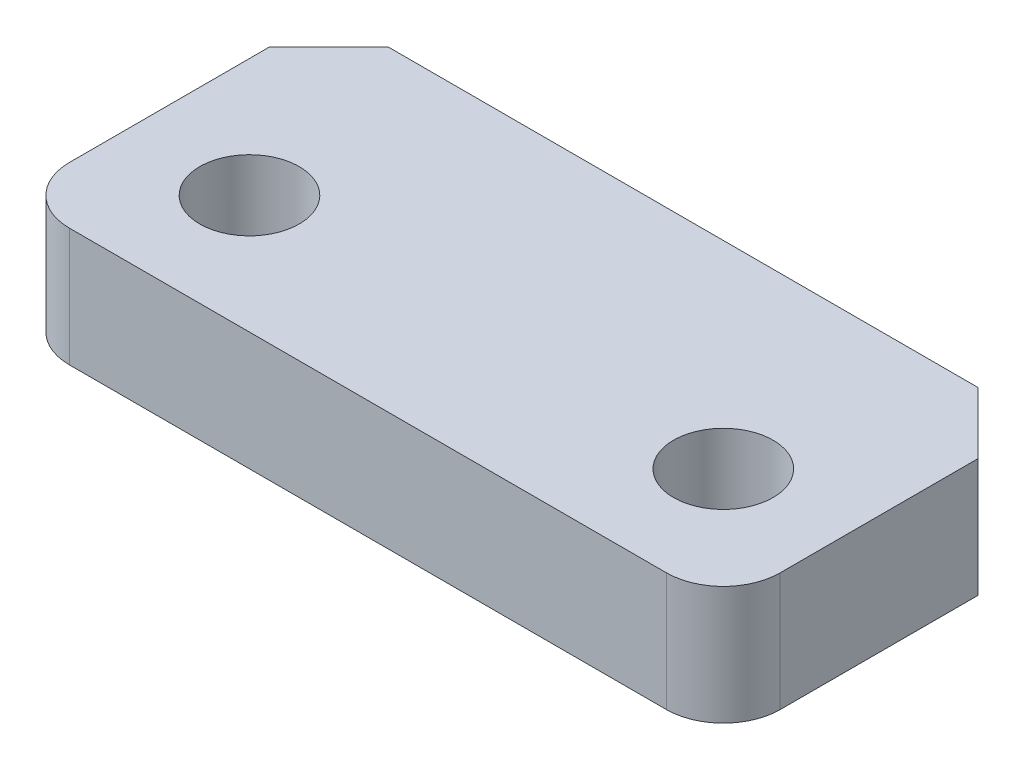
ISO-10303-21;
HEADER;
FILE_DESCRIPTION(('STEP AP214'),'2;1');
FILE_NAME('part.step','',(''),(''),'','','');
FILE_SCHEMA(('AUTOMOTIVE_DESIGN { 1 0 10303 214 1 1 1 1 }'));
ENDSEC;
DATA;
#1=APPLICATION_CONTEXT('core data for automotive mechanical design processes');
#2=APPLICATION_PROTOCOL_DEFINITION('international standard','automotive_design',2000,#1);
#3=PRODUCT_CONTEXT('',#1,'mechanical');
#4=PRODUCT('Part','Part','',(#3));
#5=PRODUCT_RELATED_PRODUCT_CATEGORY('part','',(#4));
#6=PRODUCT_DEFINITION_FORMATION('','',#4);
#7=PRODUCT_DEFINITION_CONTEXT('part definition',#1,'design');
#8=PRODUCT_DEFINITION('design','',#6,#7);
#9=PRODUCT_DEFINITION_SHAPE('','',#8);
#10=(LENGTH_UNIT() NAMED_UNIT(*) SI_UNIT(.MILLI.,.METRE.));
#11=(NAMED_UNIT(*) PLANE_ANGLE_UNIT() SI_UNIT($,.RADIAN.));
#12=(NAMED_UNIT(*) SI_UNIT($,.STERADIAN.) SOLID_ANGLE_UNIT());
#13=UNCERTAINTY_MEASURE_WITH_UNIT(LENGTH_MEASURE(1.E-05),#10,'distance_accuracy_value','');
#14=(GEOMETRIC_REPRESENTATION_CONTEXT(3) GLOBAL_UNCERTAINTY_ASSIGNED_CONTEXT((#13)) GLOBAL_UNIT_ASSIGNED_CONTEXT((#10,
#11,#12)) REPRESENTATION_CONTEXT('',''));
#15=CARTESIAN_POINT('',(0.,0.,0.));
#16=DIRECTION('',(0.,0.,1.));
#17=DIRECTION('',(1.,0.,0.));
#18=AXIS2_PLACEMENT_3D('',#15,#16,#17);
#19=CARTESIAN_POINT('',(19.05,6.35,10.6045));
#20=DIRECTION('',(-1.,0.,0.));
#21=DIRECTION('',(0.,0.,1.));
#22=AXIS2_PLACEMENT_3D('',#19,#20,#21);
#23=PLANE('',#22);
#24=DIRECTION('',(0.,0.,-1.));
#25=VECTOR('',#24,1.);
#26=CARTESIAN_POINT('',(19.05,6.35,10.6045));
#27=LINE('',#26,#25);
#28=CARTESIAN_POINT('',(19.05,6.35,3.30199999999998));
#29=VERTEX_POINT('',#28);
#30=CARTESIAN_POINT('',(19.05,6.35,-7.30250000000009));
#31=VERTEX_POINT('',#30);
#32=EDGE_CURVE('E122',#29,#31,#27,.T.);
#33=ORIENTED_EDGE('',*,*,#32,.F.);
#34=DIRECTION('',(0.,1.,0.));
#35=VECTOR('',#34,1.);
#36=CARTESIAN_POINT('',(19.05,6.35,3.30199999999998));
#37=LINE('',#36,#35);
#38=CARTESIAN_POINT('',(19.05,0.,3.30199999999998));
#39=VERTEX_POINT('',#38);
#40=EDGE_CURVE('E57',#29,#39,#37,.F.);
#41=ORIENTED_EDGE('',*,*,#40,.T.);
#42=DIRECTION('',(0.,0.,-1.));
#43=VECTOR('',#42,1.);
#44=CARTESIAN_POINT('',(19.05,0.,10.6045));
#45=LINE('',#44,#43);
#46=CARTESIAN_POINT('',(19.05,0.,-7.30250000000008));
#47=VERTEX_POINT('',#46);
#48=EDGE_CURVE('E137',#39,#47,#45,.T.);
#49=ORIENTED_EDGE('',*,*,#48,.T.);
#50=DIRECTION('',(0.,1.,0.));
#51=VECTOR('',#50,1.);
#52=CARTESIAN_POINT('',(19.05,-3.175,-7.30250000000009));
#53=LINE('',#52,#51);
#54=EDGE_CURVE('E114',#47,#31,#53,.T.);
#55=ORIENTED_EDGE('',*,*,#54,.T.);
#56=EDGE_LOOP('',(#33,#41,#49,#55));
#57=FACE_BOUND('',#56,.T.);
#58=ADVANCED_FACE('F34',(#57),#23,.F.);
#59=CARTESIAN_POINT('',(-19.05,6.35,-10.6045));
#60=DIRECTION('',(0.,0.,1.));
#61=DIRECTION('',(1.,0.,0.));
#62=AXIS2_PLACEMENT_3D('',#59,#60,#61);
#63=PLANE('',#62);
#64=DIRECTION('',(-1.,0.,0.));
#65=VECTOR('',#64,1.);
#66=CARTESIAN_POINT('',(-19.05,6.35,-10.6045));
#67=LINE('',#66,#65);
#68=CARTESIAN_POINT('',(15.748,6.35,-10.6045));
#69=VERTEX_POINT('',#68);
#70=CARTESIAN_POINT('',(-15.875,6.35,-10.6045));
#71=VERTEX_POINT('',#70);
#72=EDGE_CURVE('E121',#69,#71,#67,.T.);
#73=ORIENTED_EDGE('',*,*,#72,.F.);
#74=DIRECTION('',(0.,1.,0.));
#75=VECTOR('',#74,1.);
#76=CARTESIAN_POINT('',(15.748,-3.175,-10.6045));
#77=LINE('',#76,#75);
#78=CARTESIAN_POINT('',(15.748,0.,-10.6045));
#79=VERTEX_POINT('',#78);
#80=EDGE_CURVE('E102',#79,#69,#77,.T.);
#81=ORIENTED_EDGE('',*,*,#80,.F.);
#82=DIRECTION('',(-1.,0.,0.));
#83=VECTOR('',#82,1.);
#84=CARTESIAN_POINT('',(-19.05,0.,-10.6045));
#85=LINE('',#84,#83);
#86=CARTESIAN_POINT('',(-15.875,0.,-10.6045));
#87=VERTEX_POINT('',#86);
#88=EDGE_CURVE('E139',#79,#87,#85,.T.);
#89=ORIENTED_EDGE('',*,*,#88,.T.);
#90=DIRECTION('',(0.,1.,0.));
#91=VECTOR('',#90,1.);
#92=CARTESIAN_POINT('',(-15.875,-3.175,-10.6045));
#93=LINE('',#92,#91);
#94=EDGE_CURVE('E127',#87,#71,#93,.T.);
#95=ORIENTED_EDGE('',*,*,#94,.T.);
#96=EDGE_LOOP('',(#73,#81,#89,#95));
#97=FACE_BOUND('',#96,.T.);
#98=ADVANCED_FACE('F126',(#97),#63,.F.);
#99=CARTESIAN_POINT('',(-19.05,6.35,10.6045));
#100=DIRECTION('',(1.,0.,0.));
#101=DIRECTION('',(0.,0.,-1.));
#102=AXIS2_PLACEMENT_3D('',#99,#100,#101);
#103=PLANE('',#102);
#104=DIRECTION('',(0.,0.,1.));
#105=VECTOR('',#104,1.);
#106=CARTESIAN_POINT('',(-19.05,0.,10.6045));
#107=LINE('',#106,#105);
#108=CARTESIAN_POINT('',(-19.05,0.,-7.42949999999993));
#109=VERTEX_POINT('',#108);
#110=CARTESIAN_POINT('',(-19.05,0.,3.30199999999999));
#111=VERTEX_POINT('',#110);
#112=EDGE_CURVE('E133',#109,#111,#107,.T.);
#113=ORIENTED_EDGE('',*,*,#112,.T.);
#114=DIRECTION('',(0.,1.,0.));
#115=VECTOR('',#114,1.);
#116=CARTESIAN_POINT('',(-19.05,6.35,3.30199999999999));
#117=LINE('',#116,#115);
#118=CARTESIAN_POINT('',(-19.05,6.35,3.30199999999999));
#119=VERTEX_POINT('',#118);
#120=EDGE_CURVE('E11',#111,#119,#117,.T.);
#121=ORIENTED_EDGE('',*,*,#120,.T.);
#122=DIRECTION('',(0.,0.,1.));
#123=VECTOR('',#122,1.);
#124=CARTESIAN_POINT('',(-19.05,6.35,10.6045));
#125=LINE('',#124,#123);
#126=CARTESIAN_POINT('',(-19.05,6.35,-7.42949999999993));
#127=VERTEX_POINT('',#126);
#128=EDGE_CURVE('E128',#127,#119,#125,.T.);
#129=ORIENTED_EDGE('',*,*,#128,.F.);
#130=DIRECTION('',(0.,1.,0.));
#131=VECTOR('',#130,1.);
#132=CARTESIAN_POINT('',(-19.05,-3.175,-7.42949999999993));
#133=LINE('',#132,#131);
#134=EDGE_CURVE('E176',#109,#127,#133,.T.);
#135=ORIENTED_EDGE('',*,*,#134,.F.);
#136=EDGE_LOOP('',(#113,#121,#129,#135));
#137=FACE_BOUND('',#136,.T.);
#138=ADVANCED_FACE('F190',(#137),#103,.F.);
#139=CARTESIAN_POINT('',(0.,6.35,0.));
#140=DIRECTION('',(0.,-1.,0.));
#141=DIRECTION('',(0.,0.,-1.));
#142=AXIS2_PLACEMENT_3D('',#139,#140,#141);
#143=PLANE('',#142);
#144=CARTESIAN_POINT('',(-12.7,6.35,0.));
#145=DIRECTION('',(0.,1.,0.));
#146=DIRECTION('',(0.,0.,1.));
#147=AXIS2_PLACEMENT_3D('',#144,#145,#146);
#148=CIRCLE('',#147,2.667);
#149=CARTESIAN_POINT('',(-12.7,6.35,2.66699999999999));
#150=VERTEX_POINT('',#149);
#151=EDGE_CURVE('E146',#150,#150,#148,.T.);
#152=ORIENTED_EDGE('',*,*,#151,.F.);
#153=EDGE_LOOP('',(#152));
#154=FACE_BOUND('',#153,.T.);
#155=CARTESIAN_POINT('',(12.7,6.35,0.));
#156=DIRECTION('',(0.,1.,0.));
#157=DIRECTION('',(0.,0.,1.));
#158=AXIS2_PLACEMENT_3D('',#155,#156,#157);
#159=CIRCLE('',#158,2.667);
#160=CARTESIAN_POINT('',(12.7,6.35,2.66699999999999));
#161=VERTEX_POINT('',#160);
#162=EDGE_CURVE('E181',#161,#161,#159,.T.);
#163=ORIENTED_EDGE('',*,*,#162,.F.);
#164=EDGE_LOOP('',(#163));
#165=FACE_BOUND('',#164,.T.);
#166=DIRECTION('',(-1.,0.,0.));
#167=VECTOR('',#166,1.);
#168=CARTESIAN_POINT('',(0.,6.35,6.34999999999998));
#169=LINE('',#168,#167);
#170=CARTESIAN_POINT('',(16.002,6.35,6.34999999999998));
#171=VERTEX_POINT('',#170);
#172=CARTESIAN_POINT('',(-16.002,6.35,6.34999999999999));
#173=VERTEX_POINT('',#172);
#174=EDGE_CURVE('E123',#171,#173,#169,.T.);
#175=ORIENTED_EDGE('',*,*,#174,.F.);
#176=CARTESIAN_POINT('',(16.002,6.35,3.30199999999998));
#177=DIRECTION('',(0.,-1.,0.));
#178=DIRECTION('',(0.,0.,-1.));
#179=AXIS2_PLACEMENT_3D('',#176,#177,#178);
#180=CIRCLE('',#179,3.048);
#181=EDGE_CURVE('E161',#171,#29,#180,.F.);
#182=ORIENTED_EDGE('',*,*,#181,.T.);
#183=ORIENTED_EDGE('',*,*,#32,.T.);
#184=DIRECTION('',(0.707106781186556,0.,0.707106781186539));
#185=VECTOR('',#184,1.);
#186=CARTESIAN_POINT('',(15.748,6.35,-10.6045));
#187=LINE('',#186,#185);
#188=EDGE_CURVE('E106',#69,#31,#187,.T.);
#189=ORIENTED_EDGE('',*,*,#188,.F.);
#190=ORIENTED_EDGE('',*,*,#72,.T.);
#191=DIRECTION('',(0.707106781186541,0.,-0.707106781186554));
#192=VECTOR('',#191,1.);
#193=CARTESIAN_POINT('',(-15.875,6.35,-10.6045));
#194=LINE('',#193,#192);
#195=EDGE_CURVE('E174',#127,#71,#194,.T.);
#196=ORIENTED_EDGE('',*,*,#195,.F.);
#197=ORIENTED_EDGE('',*,*,#128,.T.);
#198=CARTESIAN_POINT('',(-16.002,6.35,3.30199999999999));
#199=DIRECTION('',(0.,-1.,0.));
#200=DIRECTION('',(0.,0.,-1.));
#201=AXIS2_PLACEMENT_3D('',#198,#199,#200);
#202=CIRCLE('',#201,3.048);
#203=EDGE_CURVE('E159',#119,#173,#202,.F.);
#204=ORIENTED_EDGE('',*,*,#203,.T.);
#205=EDGE_LOOP('',(#175,#182,#183,#189,#190,#196,#197,#204));
#206=FACE_BOUND('',#205,.T.);
#207=ADVANCED_FACE('F119',(#154,#165,#206),#143,.F.);
#208=CARTESIAN_POINT('',(0.,0.,0.));
#209=DIRECTION('',(0.,-1.,0.));
#210=DIRECTION('',(0.,0.,-1.));
#211=AXIS2_PLACEMENT_3D('',#208,#209,#210);
#212=PLANE('',#211);
#213=ORIENTED_EDGE('',*,*,#48,.F.);
#214=CARTESIAN_POINT('',(16.002,0.,3.30199999999998));
#215=DIRECTION('',(0.,-1.,0.));
#216=DIRECTION('',(0.,0.,-1.));
#217=AXIS2_PLACEMENT_3D('',#214,#215,#216);
#218=CIRCLE('',#217,3.048);
#219=CARTESIAN_POINT('',(16.002,0.,6.34999999999998));
#220=VERTEX_POINT('',#219);
#221=EDGE_CURVE('E42',#39,#220,#218,.T.);
#222=ORIENTED_EDGE('',*,*,#221,.T.);
#223=DIRECTION('',(1.,0.,0.));
#224=VECTOR('',#223,1.);
#225=CARTESIAN_POINT('',(0.,0.,6.34999999999998));
#226=LINE('',#225,#224);
#227=CARTESIAN_POINT('',(-16.002,0.,6.34999999999999));
#228=VERTEX_POINT('',#227);
#229=EDGE_CURVE('E151',#228,#220,#226,.T.);
#230=ORIENTED_EDGE('',*,*,#229,.F.);
#231=CARTESIAN_POINT('',(-16.002,0.,3.30199999999999));
#232=DIRECTION('',(0.,-1.,0.));
#233=DIRECTION('',(0.,0.,-1.));
#234=AXIS2_PLACEMENT_3D('',#231,#232,#233);
#235=CIRCLE('',#234,3.048);
#236=EDGE_CURVE('E49',#228,#111,#235,.T.);
#237=ORIENTED_EDGE('',*,*,#236,.T.);
#238=ORIENTED_EDGE('',*,*,#112,.F.);
#239=DIRECTION('',(-0.707106781186541,0.,0.707106781186554));
#240=VECTOR('',#239,1.);
#241=CARTESIAN_POINT('',(-13.2397500000001,0.,-13.2397499999999));
#242=LINE('',#241,#240);
#243=EDGE_CURVE('E131',#87,#109,#242,.T.);
#244=ORIENTED_EDGE('',*,*,#243,.F.);
#245=ORIENTED_EDGE('',*,*,#88,.F.);
#246=DIRECTION('',(-0.707106781186556,0.,-0.707106781186539));
#247=VECTOR('',#246,1.);
#248=CARTESIAN_POINT('',(13.1762499999998,0.,-13.1762500000001));
#249=LINE('',#248,#247);
#250=EDGE_CURVE('E109',#47,#79,#249,.T.);
#251=ORIENTED_EDGE('',*,*,#250,.F.);
#252=EDGE_LOOP('',(#213,#222,#230,#237,#238,#244,#245,#251));
#253=FACE_BOUND('',#252,.T.);
#254=CARTESIAN_POINT('',(-12.7,0.,0.));
#255=DIRECTION('',(0.,-1.,0.));
#256=DIRECTION('',(0.,0.,-1.));
#257=AXIS2_PLACEMENT_3D('',#254,#255,#256);
#258=CIRCLE('',#257,2.667);
#259=CARTESIAN_POINT('',(-12.7,0.,-2.66700000000001));
#260=VERTEX_POINT('',#259);
#261=EDGE_CURVE('E140',#260,#260,#258,.T.);
#262=ORIENTED_EDGE('',*,*,#261,.F.);
#263=EDGE_LOOP('',(#262));
#264=FACE_BOUND('',#263,.T.);
#265=CARTESIAN_POINT('',(12.7,0.,0.));
#266=DIRECTION('',(0.,-1.,0.));
#267=DIRECTION('',(0.,0.,-1.));
#268=AXIS2_PLACEMENT_3D('',#265,#266,#267);
#269=CIRCLE('',#268,2.667);
#270=CARTESIAN_POINT('',(12.7,0.,-2.66700000000001));
#271=VERTEX_POINT('',#270);
#272=EDGE_CURVE('E143',#271,#271,#269,.T.);
#273=ORIENTED_EDGE('',*,*,#272,.F.);
#274=EDGE_LOOP('',(#273));
#275=FACE_BOUND('',#274,.T.);
#276=ADVANCED_FACE('F165',(#253,#264,#275),#212,.T.);
#277=CARTESIAN_POINT('',(12.7,-3.175,0.));
#278=DIRECTION('',(0.,1.,0.));
#279=DIRECTION('',(0.,0.,1.));
#280=AXIS2_PLACEMENT_3D('',#277,#278,#279);
#281=CYLINDRICAL_SURFACE('',#280,2.667);
#282=ORIENTED_EDGE('',*,*,#272,.T.);
#283=EDGE_LOOP('',(#282));
#284=FACE_BOUND('',#283,.T.);
#285=ORIENTED_EDGE('',*,*,#162,.T.);
#286=EDGE_LOOP('',(#285));
#287=FACE_BOUND('',#286,.T.);
#288=ADVANCED_FACE('F187',(#284,#287),#281,.F.);
#289=CARTESIAN_POINT('',(-12.7,-3.175,0.));
#290=DIRECTION('',(0.,1.,0.));
#291=DIRECTION('',(0.,0.,1.));
#292=AXIS2_PLACEMENT_3D('',#289,#290,#291);
#293=CYLINDRICAL_SURFACE('',#292,2.667);
#294=ORIENTED_EDGE('',*,*,#261,.T.);
#295=EDGE_LOOP('',(#294));
#296=FACE_BOUND('',#295,.T.);
#297=ORIENTED_EDGE('',*,*,#151,.T.);
#298=EDGE_LOOP('',(#297));
#299=FACE_BOUND('',#298,.T.);
#300=ADVANCED_FACE('F223',(#296,#299),#293,.F.);
#301=CARTESIAN_POINT('',(-15.875,-3.175,-10.6045));
#302=DIRECTION('',(0.707106781186554,0.,0.707106781186541));
#303=DIRECTION('',(0.707106781186541,0.,-0.707106781186554));
#304=AXIS2_PLACEMENT_3D('',#301,#302,#303);
#305=PLANE('',#304);
#306=ORIENTED_EDGE('',*,*,#243,.T.);
#307=ORIENTED_EDGE('',*,*,#134,.T.);
#308=ORIENTED_EDGE('',*,*,#195,.T.);
#309=ORIENTED_EDGE('',*,*,#94,.F.);
#310=EDGE_LOOP('',(#306,#307,#308,#309));
#311=FACE_BOUND('',#310,.T.);
#312=ADVANCED_FACE('F218',(#311),#305,.F.);
#313=CARTESIAN_POINT('',(15.748,-3.175,-10.6045));
#314=DIRECTION('',(-0.707106781186539,0.,0.707106781186556));
#315=DIRECTION('',(0.707106781186556,0.,0.707106781186539));
#316=AXIS2_PLACEMENT_3D('',#313,#314,#315);
#317=PLANE('',#316);
#318=ORIENTED_EDGE('',*,*,#250,.T.);
#319=ORIENTED_EDGE('',*,*,#80,.T.);
#320=ORIENTED_EDGE('',*,*,#188,.T.);
#321=ORIENTED_EDGE('',*,*,#54,.F.);
#322=EDGE_LOOP('',(#318,#319,#320,#321));
#323=FACE_BOUND('',#322,.T.);
#324=ADVANCED_FACE('F104',(#323),#317,.F.);
#325=CARTESIAN_POINT('',(0.,-3.175,6.34999999999998));
#326=DIRECTION('',(0.,0.,-1.));
#327=DIRECTION('',(-1.,0.,0.));
#328=AXIS2_PLACEMENT_3D('',#325,#326,#327);
#329=PLANE('',#328);
#330=ORIENTED_EDGE('',*,*,#229,.T.);
#331=DIRECTION('',(0.,1.,0.));
#332=VECTOR('',#331,1.);
#333=CARTESIAN_POINT('',(16.002,-3.175,6.34999999999998));
#334=LINE('',#333,#332);
#335=EDGE_CURVE('E156',#220,#171,#334,.T.);
#336=ORIENTED_EDGE('',*,*,#335,.T.);
#337=ORIENTED_EDGE('',*,*,#174,.T.);
#338=DIRECTION('',(0.,1.,0.));
#339=VECTOR('',#338,1.);
#340=CARTESIAN_POINT('',(-16.002,-3.175,6.34999999999999));
#341=LINE('',#340,#339);
#342=EDGE_CURVE('E154',#173,#228,#341,.F.);
#343=ORIENTED_EDGE('',*,*,#342,.T.);
#344=EDGE_LOOP('',(#330,#336,#337,#343));
#345=FACE_BOUND('',#344,.T.);
#346=ADVANCED_FACE('F170',(#345),#329,.F.);
#347=CARTESIAN_POINT('',(16.002,-3.175,3.30199999999998));
#348=DIRECTION('',(0.,1.,0.));
#349=DIRECTION('',(0.,0.,1.));
#350=AXIS2_PLACEMENT_3D('',#347,#348,#349);
#351=CYLINDRICAL_SURFACE('',#350,3.048);
#352=ORIENTED_EDGE('',*,*,#221,.F.);
#353=ORIENTED_EDGE('',*,*,#40,.F.);
#354=ORIENTED_EDGE('',*,*,#181,.F.);
#355=ORIENTED_EDGE('',*,*,#335,.F.);
#356=EDGE_LOOP('',(#352,#353,#354,#355));
#357=FACE_BOUND('',#356,.T.);
#358=ADVANCED_FACE('F173',(#357),#351,.T.);
#359=CARTESIAN_POINT('',(-16.002,6.35,3.30199999999999));
#360=DIRECTION('',(0.,1.,0.));
#361=DIRECTION('',(0.,0.,1.));
#362=AXIS2_PLACEMENT_3D('',#359,#360,#361);
#363=CYLINDRICAL_SURFACE('',#362,3.048);
#364=ORIENTED_EDGE('',*,*,#236,.F.);
#365=ORIENTED_EDGE('',*,*,#342,.F.);
#366=ORIENTED_EDGE('',*,*,#203,.F.);
#367=ORIENTED_EDGE('',*,*,#120,.F.);
#368=EDGE_LOOP('',(#364,#365,#366,#367));
#369=FACE_BOUND('',#368,.T.);
#370=ADVANCED_FACE('F36',(#369),#363,.T.);
#371=CLOSED_SHELL('',(#58,#98,#138,#207,#276,#288,#300,#312,#324,#346,#358,#370));
#372=MANIFOLD_SOLID_BREP('B2',#371);
#373=ADVANCED_BREP_SHAPE_REPRESENTATION('',(#18,#372),#14);
#374=SHAPE_DEFINITION_REPRESENTATION(#9,#373);
ENDSEC;
END-ISO-10303-21;
